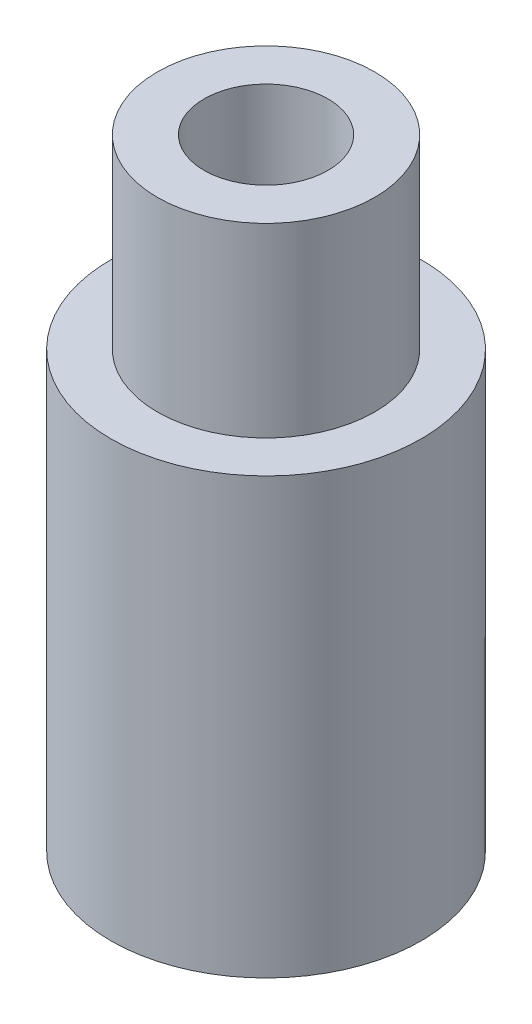
ISO-10303-21;
HEADER;
FILE_DESCRIPTION(('STEP AP214'),'2;1');
FILE_NAME('part.step','',(''),(''),'','','');
FILE_SCHEMA(('AUTOMOTIVE_DESIGN { 1 0 10303 214 1 1 1 1 }'));
ENDSEC;
DATA;
#1=APPLICATION_CONTEXT('core data for automotive mechanical design processes');
#2=APPLICATION_PROTOCOL_DEFINITION('international standard','automotive_design',2000,#1);
#3=PRODUCT_CONTEXT('',#1,'mechanical');
#4=PRODUCT('Part','Part','',(#3));
#5=PRODUCT_RELATED_PRODUCT_CATEGORY('part','',(#4));
#6=PRODUCT_DEFINITION_FORMATION('','',#4);
#7=PRODUCT_DEFINITION_CONTEXT('part definition',#1,'design');
#8=PRODUCT_DEFINITION('design','',#6,#7);
#9=PRODUCT_DEFINITION_SHAPE('','',#8);
#10=(LENGTH_UNIT() NAMED_UNIT(*) SI_UNIT(.MILLI.,.METRE.));
#11=(NAMED_UNIT(*) PLANE_ANGLE_UNIT() SI_UNIT($,.RADIAN.));
#12=(NAMED_UNIT(*) SI_UNIT($,.STERADIAN.) SOLID_ANGLE_UNIT());
#13=UNCERTAINTY_MEASURE_WITH_UNIT(LENGTH_MEASURE(1.E-05),#10,'distance_accuracy_value','');
#14=(GEOMETRIC_REPRESENTATION_CONTEXT(3) GLOBAL_UNCERTAINTY_ASSIGNED_CONTEXT((#13)) GLOBAL_UNIT_ASSIGNED_CONTEXT((#10,
#11,#12)) REPRESENTATION_CONTEXT('',''));
#15=CARTESIAN_POINT('',(0.,0.,0.));
#16=DIRECTION('',(0.,0.,1.));
#17=DIRECTION('',(1.,0.,0.));
#18=AXIS2_PLACEMENT_3D('',#15,#16,#17);
#19=CARTESIAN_POINT('',(0.,0.,0.));
#20=DIRECTION('',(0.,1.,0.));
#21=DIRECTION('',(0.,0.,1.));
#22=AXIS2_PLACEMENT_3D('',#19,#20,#21);
#23=CYLINDRICAL_SURFACE('',#22,0.99949);
#24=CARTESIAN_POINT('',(0.,10.0076,0.));
#25=DIRECTION('',(0.,1.,0.));
#26=DIRECTION('',(0.,0.,1.));
#27=AXIS2_PLACEMENT_3D('',#24,#25,#26);
#28=CIRCLE('',#27,0.99949);
#29=CARTESIAN_POINT('',(0.,10.0076,0.99949));
#30=VERTEX_POINT('',#29);
#31=EDGE_CURVE('E54',#30,#30,#28,.T.);
#32=ORIENTED_EDGE('',*,*,#31,.T.);
#33=EDGE_LOOP('',(#32));
#34=FACE_BOUND('',#33,.T.);
#35=CARTESIAN_POINT('',(0.,6.985,0.));
#36=DIRECTION('',(0.,-1.,0.));
#37=DIRECTION('',(0.,0.,-1.));
#38=AXIS2_PLACEMENT_3D('',#35,#36,#37);
#39=CIRCLE('',#38,0.99949);
#40=CARTESIAN_POINT('',(0.,6.985,-0.99949));
#41=VERTEX_POINT('',#40);
#42=EDGE_CURVE('E36',#41,#41,#39,.F.);
#43=ORIENTED_EDGE('',*,*,#42,.F.);
#44=EDGE_LOOP('',(#43));
#45=FACE_BOUND('',#44,.T.);
#46=ADVANCED_FACE('F32',(#34,#45),#23,.F.);
#47=CARTESIAN_POINT('',(0.,7.0104,0.));
#48=DIRECTION('',(0.,-1.,0.));
#49=DIRECTION('',(0.,0.,-1.));
#50=AXIS2_PLACEMENT_3D('',#47,#48,#49);
#51=CYLINDRICAL_SURFACE('',#50,2.5019);
#52=CARTESIAN_POINT('',(0.,7.0104,0.));
#53=DIRECTION('',(0.,1.,0.));
#54=DIRECTION('',(0.,0.,1.));
#55=AXIS2_PLACEMENT_3D('',#52,#53,#54);
#56=CIRCLE('',#55,2.5019);
#57=CARTESIAN_POINT('',(0.,7.0104,2.5019));
#58=VERTEX_POINT('',#57);
#59=EDGE_CURVE('E40',#58,#58,#56,.T.);
#60=ORIENTED_EDGE('',*,*,#59,.F.);
#61=EDGE_LOOP('',(#60));
#62=FACE_BOUND('',#61,.T.);
#63=CARTESIAN_POINT('',(0.,0.,0.));
#64=DIRECTION('',(0.,1.,0.));
#65=DIRECTION('',(0.,0.,1.));
#66=AXIS2_PLACEMENT_3D('',#63,#64,#65);
#67=CIRCLE('',#66,2.5019);
#68=CARTESIAN_POINT('',(0.,0.,2.5019));
#69=VERTEX_POINT('',#68);
#70=EDGE_CURVE('E45',#69,#69,#67,.T.);
#71=ORIENTED_EDGE('',*,*,#70,.T.);
#72=EDGE_LOOP('',(#71));
#73=FACE_BOUND('',#72,.T.);
#74=ADVANCED_FACE('F34',(#62,#73),#51,.T.);
#75=CARTESIAN_POINT('',(0.,7.0104,0.));
#76=DIRECTION('',(0.,1.,0.));
#77=DIRECTION('',(0.,0.,1.));
#78=AXIS2_PLACEMENT_3D('',#75,#76,#77);
#79=PLANE('',#78);
#80=CARTESIAN_POINT('',(0.,7.0104,0.));
#81=DIRECTION('',(0.,1.,0.));
#82=DIRECTION('',(0.,0.,1.));
#83=AXIS2_PLACEMENT_3D('',#80,#81,#82);
#84=CIRCLE('',#83,1.7526);
#85=CARTESIAN_POINT('',(0.,7.0104,1.7526));
#86=VERTEX_POINT('',#85);
#87=EDGE_CURVE('E10',#86,#86,#84,.T.);
#88=ORIENTED_EDGE('',*,*,#87,.F.);
#89=EDGE_LOOP('',(#88));
#90=FACE_BOUND('',#89,.T.);
#91=ORIENTED_EDGE('',*,*,#59,.T.);
#92=EDGE_LOOP('',(#91));
#93=FACE_BOUND('',#92,.T.);
#94=ADVANCED_FACE('F82',(#90,#93),#79,.T.);
#95=CARTESIAN_POINT('',(0.,0.,0.));
#96=DIRECTION('',(0.,1.,0.));
#97=DIRECTION('',(0.,0.,1.));
#98=AXIS2_PLACEMENT_3D('',#95,#96,#97);
#99=PLANE('',#98);
#100=CARTESIAN_POINT('',(0.,0.,0.));
#101=DIRECTION('',(0.,-1.,0.));
#102=DIRECTION('',(0.,0.,-1.));
#103=AXIS2_PLACEMENT_3D('',#100,#101,#102);
#104=CIRCLE('',#103,1.9939);
#105=CARTESIAN_POINT('',(0.,0.,-1.9939));
#106=VERTEX_POINT('',#105);
#107=EDGE_CURVE('E63',#106,#106,#104,.T.);
#108=ORIENTED_EDGE('',*,*,#107,.F.);
#109=EDGE_LOOP('',(#108));
#110=FACE_BOUND('',#109,.T.);
#111=ORIENTED_EDGE('',*,*,#70,.F.);
#112=EDGE_LOOP('',(#111));
#113=FACE_BOUND('',#112,.T.);
#114=ADVANCED_FACE('F78',(#110,#113),#99,.F.);
#115=CARTESIAN_POINT('',(0.,10.0076,0.));
#116=DIRECTION('',(0.,-1.,0.));
#117=DIRECTION('',(0.,0.,-1.));
#118=AXIS2_PLACEMENT_3D('',#115,#116,#117);
#119=CYLINDRICAL_SURFACE('',#118,1.7526);
#120=CARTESIAN_POINT('',(0.,10.0076,0.));
#121=DIRECTION('',(0.,1.,0.));
#122=DIRECTION('',(0.,0.,1.));
#123=AXIS2_PLACEMENT_3D('',#120,#121,#122);
#124=CIRCLE('',#123,1.7526);
#125=CARTESIAN_POINT('',(0.,10.0076,1.7526));
#126=VERTEX_POINT('',#125);
#127=EDGE_CURVE('E48',#126,#126,#124,.T.);
#128=ORIENTED_EDGE('',*,*,#127,.F.);
#129=EDGE_LOOP('',(#128));
#130=FACE_BOUND('',#129,.T.);
#131=ORIENTED_EDGE('',*,*,#87,.T.);
#132=EDGE_LOOP('',(#131));
#133=FACE_BOUND('',#132,.T.);
#134=ADVANCED_FACE('F81',(#130,#133),#119,.T.);
#135=CARTESIAN_POINT('',(0.,10.0076,0.));
#136=DIRECTION('',(0.,1.,0.));
#137=DIRECTION('',(0.,0.,1.));
#138=AXIS2_PLACEMENT_3D('',#135,#136,#137);
#139=PLANE('',#138);
#140=ORIENTED_EDGE('',*,*,#31,.F.);
#141=EDGE_LOOP('',(#140));
#142=FACE_BOUND('',#141,.T.);
#143=ORIENTED_EDGE('',*,*,#127,.T.);
#144=EDGE_LOOP('',(#143));
#145=FACE_BOUND('',#144,.T.);
#146=ADVANCED_FACE('F87',(#142,#145),#139,.T.);
#147=CARTESIAN_POINT('',(0.,6.985,0.));
#148=DIRECTION('',(0.,-1.,0.));
#149=DIRECTION('',(0.,0.,-1.));
#150=AXIS2_PLACEMENT_3D('',#147,#148,#149);
#151=PLANE('',#150);
#152=CARTESIAN_POINT('',(0.,6.985,0.));
#153=DIRECTION('',(0.,-1.,0.));
#154=DIRECTION('',(0.,0.,-1.));
#155=AXIS2_PLACEMENT_3D('',#152,#153,#154);
#156=CIRCLE('',#155,1.9939);
#157=CARTESIAN_POINT('',(0.,6.985,-1.9939));
#158=VERTEX_POINT('',#157);
#159=EDGE_CURVE('E61',#158,#158,#156,.T.);
#160=ORIENTED_EDGE('',*,*,#159,.T.);
#161=EDGE_LOOP('',(#160));
#162=FACE_BOUND('',#161,.T.);
#163=ORIENTED_EDGE('',*,*,#42,.T.);
#164=EDGE_LOOP('',(#163));
#165=FACE_BOUND('',#164,.T.);
#166=ADVANCED_FACE('F69',(#162,#165),#151,.T.);
#167=CARTESIAN_POINT('',(0.,6.985,0.));
#168=DIRECTION('',(0.,-1.,0.));
#169=DIRECTION('',(0.,0.,-1.));
#170=AXIS2_PLACEMENT_3D('',#167,#168,#169);
#171=CYLINDRICAL_SURFACE('',#170,1.9939);
#172=ORIENTED_EDGE('',*,*,#159,.F.);
#173=EDGE_LOOP('',(#172));
#174=FACE_BOUND('',#173,.T.);
#175=ORIENTED_EDGE('',*,*,#107,.T.);
#176=EDGE_LOOP('',(#175));
#177=FACE_BOUND('',#176,.T.);
#178=ADVANCED_FACE('F72',(#174,#177),#171,.F.);
#179=CLOSED_SHELL('',(#46,#74,#94,#114,#134,#146,#166,#178));
#180=MANIFOLD_SOLID_BREP('B2',#179);
#181=ADVANCED_BREP_SHAPE_REPRESENTATION('',(#18,#180),#14);
#182=SHAPE_DEFINITION_REPRESENTATION(#9,#181);
ENDSEC;
END-ISO-10303-21;
